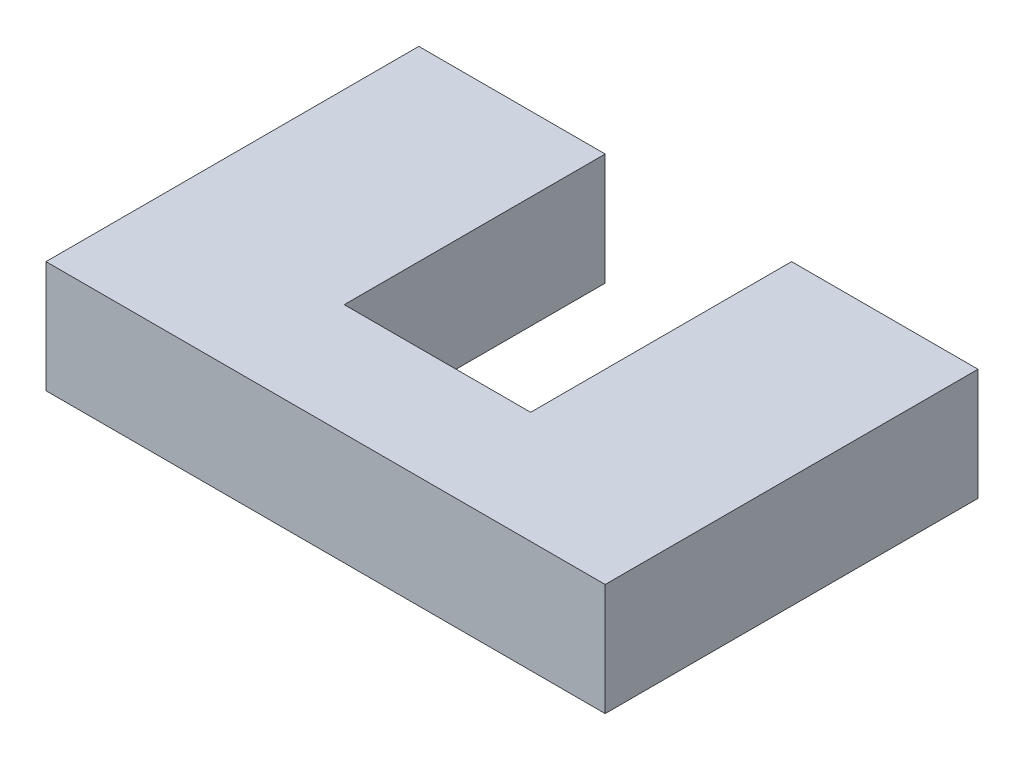
ISO-10303-21;
HEADER;
FILE_DESCRIPTION(('STEP AP214'),'2;1');
FILE_NAME('part.step','',(''),(''),'','','');
FILE_SCHEMA(('AUTOMOTIVE_DESIGN { 1 0 10303 214 1 1 1 1 }'));
ENDSEC;
DATA;
#1=APPLICATION_CONTEXT('core data for automotive mechanical design processes');
#2=APPLICATION_PROTOCOL_DEFINITION('international standard','automotive_design',2000,#1);
#3=PRODUCT_CONTEXT('',#1,'mechanical');
#4=PRODUCT('Part','Part','',(#3));
#5=PRODUCT_RELATED_PRODUCT_CATEGORY('part','',(#4));
#6=PRODUCT_DEFINITION_FORMATION('','',#4);
#7=PRODUCT_DEFINITION_CONTEXT('part definition',#1,'design');
#8=PRODUCT_DEFINITION('design','',#6,#7);
#9=PRODUCT_DEFINITION_SHAPE('','',#8);
#10=(LENGTH_UNIT() NAMED_UNIT(*) SI_UNIT(.MILLI.,.METRE.));
#11=(NAMED_UNIT(*) PLANE_ANGLE_UNIT() SI_UNIT($,.RADIAN.));
#12=(NAMED_UNIT(*) SI_UNIT($,.STERADIAN.) SOLID_ANGLE_UNIT());
#13=UNCERTAINTY_MEASURE_WITH_UNIT(LENGTH_MEASURE(1.E-05),#10,'distance_accuracy_value','');
#14=(GEOMETRIC_REPRESENTATION_CONTEXT(3) GLOBAL_UNCERTAINTY_ASSIGNED_CONTEXT((#13)) GLOBAL_UNIT_ASSIGNED_CONTEXT((#10,
#11,#12)) REPRESENTATION_CONTEXT('',''));
#15=CARTESIAN_POINT('',(0.,0.,0.));
#16=DIRECTION('',(0.,0.,1.));
#17=DIRECTION('',(1.,0.,0.));
#18=AXIS2_PLACEMENT_3D('',#15,#16,#17);
#19=CARTESIAN_POINT('',(0.,0.6,0.));
#20=DIRECTION('',(0.,0.,1.));
#21=DIRECTION('',(1.,0.,0.));
#22=AXIS2_PLACEMENT_3D('',#19,#20,#21);
#23=PLANE('',#22);
#24=DIRECTION('',(-1.,0.,0.));
#25=VECTOR('',#24,1.);
#26=CARTESIAN_POINT('',(0.,0.6,0.));
#27=LINE('',#26,#25);
#28=CARTESIAN_POINT('',(1.,0.6,0.));
#29=VERTEX_POINT('',#28);
#30=CARTESIAN_POINT('',(0.,0.6,0.));
#31=VERTEX_POINT('',#30);
#32=EDGE_CURVE('E68',#29,#31,#27,.T.);
#33=ORIENTED_EDGE('',*,*,#32,.F.);
#34=DIRECTION('',(0.,1.,0.));
#35=VECTOR('',#34,1.);
#36=CARTESIAN_POINT('',(1.,0.,0.));
#37=LINE('',#36,#35);
#38=CARTESIAN_POINT('',(1.,0.,0.));
#39=VERTEX_POINT('',#38);
#40=EDGE_CURVE('E151',#39,#29,#37,.T.);
#41=ORIENTED_EDGE('',*,*,#40,.F.);
#42=DIRECTION('',(-1.,0.,0.));
#43=VECTOR('',#42,1.);
#44=CARTESIAN_POINT('',(0.,0.,0.));
#45=LINE('',#44,#43);
#46=CARTESIAN_POINT('',(0.,0.,0.));
#47=VERTEX_POINT('',#46);
#48=EDGE_CURVE('E90',#39,#47,#45,.T.);
#49=ORIENTED_EDGE('',*,*,#48,.T.);
#50=DIRECTION('',(0.,-1.,0.));
#51=VECTOR('',#50,1.);
#52=CARTESIAN_POINT('',(0.,0.6,0.));
#53=LINE('',#52,#51);
#54=EDGE_CURVE('E174',#31,#47,#53,.T.);
#55=ORIENTED_EDGE('',*,*,#54,.F.);
#56=EDGE_LOOP('',(#33,#41,#49,#55));
#57=FACE_BOUND('',#56,.T.);
#58=ADVANCED_FACE('F43',(#57),#23,.F.);
#59=CARTESIAN_POINT('',(0.,0.6,0.));
#60=DIRECTION('',(1.,0.,0.));
#61=DIRECTION('',(0.,0.,-1.));
#62=AXIS2_PLACEMENT_3D('',#59,#60,#61);
#63=PLANE('',#62);
#64=DIRECTION('',(0.,0.,1.));
#65=VECTOR('',#64,1.);
#66=CARTESIAN_POINT('',(0.,0.,0.));
#67=LINE('',#66,#65);
#68=CARTESIAN_POINT('',(0.,0.,2.));
#69=VERTEX_POINT('',#68);
#70=EDGE_CURVE('E154',#47,#69,#67,.T.);
#71=ORIENTED_EDGE('',*,*,#70,.T.);
#72=DIRECTION('',(0.,-1.,0.));
#73=VECTOR('',#72,1.);
#74=CARTESIAN_POINT('',(0.,0.6,2.));
#75=LINE('',#74,#73);
#76=CARTESIAN_POINT('',(0.,0.6,2.));
#77=VERTEX_POINT('',#76);
#78=EDGE_CURVE('E11',#77,#69,#75,.T.);
#79=ORIENTED_EDGE('',*,*,#78,.F.);
#80=DIRECTION('',(0.,0.,1.));
#81=VECTOR('',#80,1.);
#82=CARTESIAN_POINT('',(0.,0.6,0.));
#83=LINE('',#82,#81);
#84=EDGE_CURVE('E161',#31,#77,#83,.T.);
#85=ORIENTED_EDGE('',*,*,#84,.F.);
#86=ORIENTED_EDGE('',*,*,#54,.T.);
#87=EDGE_LOOP('',(#71,#79,#85,#86));
#88=FACE_BOUND('',#87,.T.);
#89=ADVANCED_FACE('F45',(#88),#63,.F.);
#90=CARTESIAN_POINT('',(0.,0.6,2.));
#91=DIRECTION('',(0.,0.,-1.));
#92=DIRECTION('',(-1.,0.,0.));
#93=AXIS2_PLACEMENT_3D('',#90,#91,#92);
#94=PLANE('',#93);
#95=DIRECTION('',(1.,0.,0.));
#96=VECTOR('',#95,1.);
#97=CARTESIAN_POINT('',(0.,0.,2.));
#98=LINE('',#97,#96);
#99=CARTESIAN_POINT('',(3.,0.,2.));
#100=VERTEX_POINT('',#99);
#101=EDGE_CURVE('E178',#69,#100,#98,.T.);
#102=ORIENTED_EDGE('',*,*,#101,.T.);
#103=DIRECTION('',(0.,-1.,0.));
#104=VECTOR('',#103,1.);
#105=CARTESIAN_POINT('',(3.,0.6,2.));
#106=LINE('',#105,#104);
#107=CARTESIAN_POINT('',(3.,0.6,2.));
#108=VERTEX_POINT('',#107);
#109=EDGE_CURVE('E52',#108,#100,#106,.T.);
#110=ORIENTED_EDGE('',*,*,#109,.F.);
#111=DIRECTION('',(1.,0.,0.));
#112=VECTOR('',#111,1.);
#113=CARTESIAN_POINT('',(0.,0.6,2.));
#114=LINE('',#113,#112);
#115=EDGE_CURVE('E97',#77,#108,#114,.T.);
#116=ORIENTED_EDGE('',*,*,#115,.F.);
#117=ORIENTED_EDGE('',*,*,#78,.T.);
#118=EDGE_LOOP('',(#102,#110,#116,#117));
#119=FACE_BOUND('',#118,.T.);
#120=ADVANCED_FACE('F208',(#119),#94,.F.);
#121=CARTESIAN_POINT('',(3.,0.6,0.));
#122=DIRECTION('',(-1.,0.,0.));
#123=DIRECTION('',(0.,0.,1.));
#124=AXIS2_PLACEMENT_3D('',#121,#122,#123);
#125=PLANE('',#124);
#126=DIRECTION('',(0.,0.,-1.));
#127=VECTOR('',#126,1.);
#128=CARTESIAN_POINT('',(3.,0.,0.));
#129=LINE('',#128,#127);
#130=CARTESIAN_POINT('',(3.,0.,0.));
#131=VERTEX_POINT('',#130);
#132=EDGE_CURVE('E181',#100,#131,#129,.T.);
#133=ORIENTED_EDGE('',*,*,#132,.T.);
#134=DIRECTION('',(0.,-1.,0.));
#135=VECTOR('',#134,1.);
#136=CARTESIAN_POINT('',(3.,0.6,0.));
#137=LINE('',#136,#135);
#138=CARTESIAN_POINT('',(3.,0.6,0.));
#139=VERTEX_POINT('',#138);
#140=EDGE_CURVE('E189',#139,#131,#137,.T.);
#141=ORIENTED_EDGE('',*,*,#140,.F.);
#142=DIRECTION('',(0.,0.,-1.));
#143=VECTOR('',#142,1.);
#144=CARTESIAN_POINT('',(3.,0.6,0.));
#145=LINE('',#144,#143);
#146=EDGE_CURVE('E167',#108,#139,#145,.T.);
#147=ORIENTED_EDGE('',*,*,#146,.F.);
#148=ORIENTED_EDGE('',*,*,#109,.T.);
#149=EDGE_LOOP('',(#133,#141,#147,#148));
#150=FACE_BOUND('',#149,.T.);
#151=ADVANCED_FACE('F197',(#150),#125,.F.);
#152=CARTESIAN_POINT('',(2.,0.,0.));
#153=VERTEX_POINT('',#152);
#154=EDGE_CURVE('E164',#131,#153,#45,.T.);
#155=ORIENTED_EDGE('',*,*,#154,.T.);
#156=DIRECTION('',(0.,1.,0.));
#157=VECTOR('',#156,1.);
#158=CARTESIAN_POINT('',(2.,0.,0.));
#159=LINE('',#158,#157);
#160=CARTESIAN_POINT('',(2.,0.6,0.));
#161=VERTEX_POINT('',#160);
#162=EDGE_CURVE('E155',#153,#161,#159,.T.);
#163=ORIENTED_EDGE('',*,*,#162,.T.);
#164=EDGE_CURVE('E170',#139,#161,#27,.T.);
#165=ORIENTED_EDGE('',*,*,#164,.F.);
#166=ORIENTED_EDGE('',*,*,#140,.T.);
#167=EDGE_LOOP('',(#155,#163,#165,#166));
#168=FACE_BOUND('',#167,.T.);
#169=ADVANCED_FACE('F201',(#168),#23,.F.);
#170=CARTESIAN_POINT('',(0.,0.6,0.));
#171=DIRECTION('',(0.,1.,0.));
#172=DIRECTION('',(0.,0.,1.));
#173=AXIS2_PLACEMENT_3D('',#170,#171,#172);
#174=PLANE('',#173);
#175=DIRECTION('',(0.,0.,1.));
#176=VECTOR('',#175,1.);
#177=CARTESIAN_POINT('',(1.,0.6,0.));
#178=LINE('',#177,#176);
#179=CARTESIAN_POINT('',(1.,0.6,1.4));
#180=VERTEX_POINT('',#179);
#181=EDGE_CURVE('E123',#29,#180,#178,.T.);
#182=ORIENTED_EDGE('',*,*,#181,.F.);
#183=ORIENTED_EDGE('',*,*,#32,.T.);
#184=ORIENTED_EDGE('',*,*,#84,.T.);
#185=ORIENTED_EDGE('',*,*,#115,.T.);
#186=ORIENTED_EDGE('',*,*,#146,.T.);
#187=ORIENTED_EDGE('',*,*,#164,.T.);
#188=DIRECTION('',(0.,0.,-1.));
#189=VECTOR('',#188,1.);
#190=CARTESIAN_POINT('',(2.,0.6,0.));
#191=LINE('',#190,#189);
#192=CARTESIAN_POINT('',(2.,0.6,1.4));
#193=VERTEX_POINT('',#192);
#194=EDGE_CURVE('E139',#193,#161,#191,.T.);
#195=ORIENTED_EDGE('',*,*,#194,.F.);
#196=DIRECTION('',(1.,0.,0.));
#197=VECTOR('',#196,1.);
#198=CARTESIAN_POINT('',(1.,0.6,1.4));
#199=LINE('',#198,#197);
#200=EDGE_CURVE('E142',#180,#193,#199,.T.);
#201=ORIENTED_EDGE('',*,*,#200,.F.);
#202=EDGE_LOOP('',(#182,#183,#184,#185,#186,#187,#195,#201));
#203=FACE_BOUND('',#202,.T.);
#204=ADVANCED_FACE('F204',(#203),#174,.T.);
#205=CARTESIAN_POINT('',(0.,0.,0.));
#206=DIRECTION('',(0.,1.,0.));
#207=DIRECTION('',(0.,0.,1.));
#208=AXIS2_PLACEMENT_3D('',#205,#206,#207);
#209=PLANE('',#208);
#210=ORIENTED_EDGE('',*,*,#48,.F.);
#211=DIRECTION('',(0.,0.,1.));
#212=VECTOR('',#211,1.);
#213=CARTESIAN_POINT('',(1.,0.,0.));
#214=LINE('',#213,#212);
#215=CARTESIAN_POINT('',(1.,0.,1.4));
#216=VERTEX_POINT('',#215);
#217=EDGE_CURVE('E122',#39,#216,#214,.T.);
#218=ORIENTED_EDGE('',*,*,#217,.T.);
#219=DIRECTION('',(1.,0.,0.));
#220=VECTOR('',#219,1.);
#221=CARTESIAN_POINT('',(1.,0.,1.4));
#222=LINE('',#221,#220);
#223=CARTESIAN_POINT('',(2.,0.,1.4));
#224=VERTEX_POINT('',#223);
#225=EDGE_CURVE('E131',#216,#224,#222,.T.);
#226=ORIENTED_EDGE('',*,*,#225,.T.);
#227=DIRECTION('',(0.,0.,-1.));
#228=VECTOR('',#227,1.);
#229=CARTESIAN_POINT('',(2.,0.,0.));
#230=LINE('',#229,#228);
#231=EDGE_CURVE('E59',#224,#153,#230,.T.);
#232=ORIENTED_EDGE('',*,*,#231,.T.);
#233=ORIENTED_EDGE('',*,*,#154,.F.);
#234=ORIENTED_EDGE('',*,*,#132,.F.);
#235=ORIENTED_EDGE('',*,*,#101,.F.);
#236=ORIENTED_EDGE('',*,*,#70,.F.);
#237=EDGE_LOOP('',(#210,#218,#226,#232,#233,#234,#235,#236));
#238=FACE_BOUND('',#237,.T.);
#239=ADVANCED_FACE('F136',(#238),#209,.F.);
#240=CARTESIAN_POINT('',(1.,0.,0.));
#241=DIRECTION('',(-1.,0.,0.));
#242=DIRECTION('',(0.,0.,1.));
#243=AXIS2_PLACEMENT_3D('',#240,#241,#242);
#244=PLANE('',#243);
#245=ORIENTED_EDGE('',*,*,#181,.T.);
#246=DIRECTION('',(0.,1.,0.));
#247=VECTOR('',#246,1.);
#248=CARTESIAN_POINT('',(1.,0.,1.4));
#249=LINE('',#248,#247);
#250=EDGE_CURVE('E118',#216,#180,#249,.T.);
#251=ORIENTED_EDGE('',*,*,#250,.F.);
#252=ORIENTED_EDGE('',*,*,#217,.F.);
#253=ORIENTED_EDGE('',*,*,#40,.T.);
#254=EDGE_LOOP('',(#245,#251,#252,#253));
#255=FACE_BOUND('',#254,.T.);
#256=ADVANCED_FACE('F120',(#255),#244,.F.);
#257=CARTESIAN_POINT('',(2.,0.,0.));
#258=DIRECTION('',(1.,0.,0.));
#259=DIRECTION('',(0.,0.,-1.));
#260=AXIS2_PLACEMENT_3D('',#257,#258,#259);
#261=PLANE('',#260);
#262=ORIENTED_EDGE('',*,*,#194,.T.);
#263=ORIENTED_EDGE('',*,*,#162,.F.);
#264=ORIENTED_EDGE('',*,*,#231,.F.);
#265=DIRECTION('',(0.,1.,0.));
#266=VECTOR('',#265,1.);
#267=CARTESIAN_POINT('',(2.,0.,1.4));
#268=LINE('',#267,#266);
#269=EDGE_CURVE('E128',#224,#193,#268,.T.);
#270=ORIENTED_EDGE('',*,*,#269,.T.);
#271=EDGE_LOOP('',(#262,#263,#264,#270));
#272=FACE_BOUND('',#271,.T.);
#273=ADVANCED_FACE('F231',(#272),#261,.F.);
#274=CARTESIAN_POINT('',(1.,0.,1.4));
#275=DIRECTION('',(0.,0.,1.));
#276=DIRECTION('',(1.,0.,0.));
#277=AXIS2_PLACEMENT_3D('',#274,#275,#276);
#278=PLANE('',#277);
#279=ORIENTED_EDGE('',*,*,#200,.T.);
#280=ORIENTED_EDGE('',*,*,#269,.F.);
#281=ORIENTED_EDGE('',*,*,#225,.F.);
#282=ORIENTED_EDGE('',*,*,#250,.T.);
#283=EDGE_LOOP('',(#279,#280,#281,#282));
#284=FACE_BOUND('',#283,.T.);
#285=ADVANCED_FACE('F132',(#284),#278,.F.);
#286=CLOSED_SHELL('',(#58,#89,#120,#151,#169,#204,#239,#256,#273,#285));
#287=MANIFOLD_SOLID_BREP('B2',#286);
#288=ADVANCED_BREP_SHAPE_REPRESENTATION('',(#18,#287),#14);
#289=SHAPE_DEFINITION_REPRESENTATION(#9,#288);
ENDSEC;
END-ISO-10303-21;
